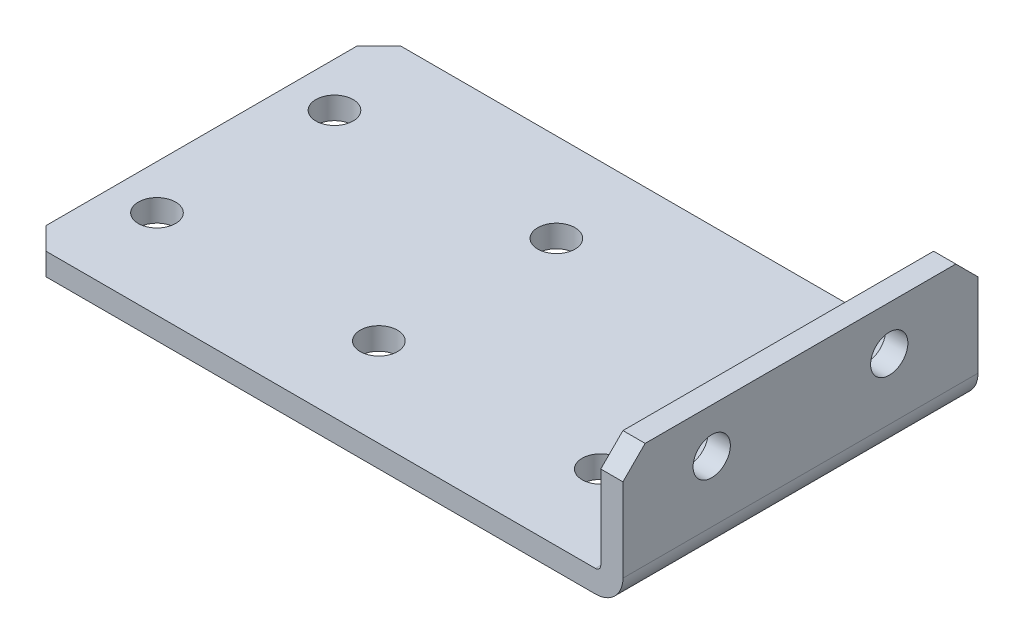
ISO-10303-21;
HEADER;
FILE_DESCRIPTION(('STEP AP214'),'2;1');
FILE_NAME('part.step','',(''),(''),'','','');
FILE_SCHEMA(('AUTOMOTIVE_DESIGN { 1 0 10303 214 1 1 1 1 }'));
ENDSEC;
DATA;
#1=APPLICATION_CONTEXT('core data for automotive mechanical design processes');
#2=APPLICATION_PROTOCOL_DEFINITION('international standard','automotive_design',2000,#1);
#3=PRODUCT_CONTEXT('',#1,'mechanical');
#4=PRODUCT('Part','Part','',(#3));
#5=PRODUCT_RELATED_PRODUCT_CATEGORY('part','',(#4));
#6=PRODUCT_DEFINITION_FORMATION('','',#4);
#7=PRODUCT_DEFINITION_CONTEXT('part definition',#1,'design');
#8=PRODUCT_DEFINITION('design','',#6,#7);
#9=PRODUCT_DEFINITION_SHAPE('','',#8);
#10=(LENGTH_UNIT() NAMED_UNIT(*) SI_UNIT(.MILLI.,.METRE.));
#11=(NAMED_UNIT(*) PLANE_ANGLE_UNIT() SI_UNIT($,.RADIAN.));
#12=(NAMED_UNIT(*) SI_UNIT($,.STERADIAN.) SOLID_ANGLE_UNIT());
#13=UNCERTAINTY_MEASURE_WITH_UNIT(LENGTH_MEASURE(1.E-05),#10,'distance_accuracy_value','');
#14=(GEOMETRIC_REPRESENTATION_CONTEXT(3) GLOBAL_UNCERTAINTY_ASSIGNED_CONTEXT((#13)) GLOBAL_UNIT_ASSIGNED_CONTEXT((#10,
#11,#12)) REPRESENTATION_CONTEXT('',''));
#15=CARTESIAN_POINT('',(0.,0.,0.));
#16=DIRECTION('',(0.,0.,1.));
#17=DIRECTION('',(1.,0.,0.));
#18=AXIS2_PLACEMENT_3D('',#15,#16,#17);
#19=CARTESIAN_POINT('',(85.7250000000001,12.7000000000001,-25.4));
#20=DIRECTION('',(-1.,0.,0.));
#21=DIRECTION('',(0.,-1.,0.));
#22=AXIS2_PLACEMENT_3D('',#19,#20,#21);
#23=CYLINDRICAL_SURFACE('',#22,2.667);
#24=CARTESIAN_POINT('',(85.7250000000001,12.7000000000001,-25.4));
#25=DIRECTION('',(-1.,0.,0.));
#26=DIRECTION('',(0.,-1.,0.));
#27=AXIS2_PLACEMENT_3D('',#24,#25,#26);
#28=CIRCLE('',#27,2.667);
#29=CARTESIAN_POINT('',(85.7250000000001,10.0330000000001,-25.4));
#30=VERTEX_POINT('',#29);
#31=EDGE_CURVE('E208',#30,#30,#28,.F.);
#32=ORIENTED_EDGE('',*,*,#31,.T.);
#33=EDGE_LOOP('',(#32));
#34=FACE_BOUND('',#33,.T.);
#35=CARTESIAN_POINT('',(82.55,12.7000000000001,-25.4));
#36=DIRECTION('',(-1.,0.,0.));
#37=DIRECTION('',(0.,-1.,0.));
#38=AXIS2_PLACEMENT_3D('',#35,#36,#37);
#39=CIRCLE('',#38,2.667);
#40=CARTESIAN_POINT('',(82.55,10.0330000000001,-25.4));
#41=VERTEX_POINT('',#40);
#42=EDGE_CURVE('E213',#41,#41,#39,.F.);
#43=ORIENTED_EDGE('',*,*,#42,.F.);
#44=EDGE_LOOP('',(#43));
#45=FACE_BOUND('',#44,.T.);
#46=ADVANCED_FACE('F18',(#34,#45),#23,.F.);
#47=CARTESIAN_POINT('',(85.7250000000001,12.7000000000001,-50.8));
#48=DIRECTION('',(-1.,0.,0.));
#49=DIRECTION('',(0.,-1.,0.));
#50=AXIS2_PLACEMENT_3D('',#47,#48,#49);
#51=CYLINDRICAL_SURFACE('',#50,2.667);
#52=CARTESIAN_POINT('',(85.7250000000001,12.7000000000001,-50.8));
#53=DIRECTION('',(-1.,0.,0.));
#54=DIRECTION('',(0.,-1.,0.));
#55=AXIS2_PLACEMENT_3D('',#52,#53,#54);
#56=CIRCLE('',#55,2.667);
#57=CARTESIAN_POINT('',(85.7250000000001,10.0330000000001,-50.8));
#58=VERTEX_POINT('',#57);
#59=EDGE_CURVE('E199',#58,#58,#56,.F.);
#60=ORIENTED_EDGE('',*,*,#59,.T.);
#61=EDGE_LOOP('',(#60));
#62=FACE_BOUND('',#61,.T.);
#63=CARTESIAN_POINT('',(82.55,12.7000000000001,-50.8));
#64=DIRECTION('',(-1.,0.,0.));
#65=DIRECTION('',(0.,-1.,0.));
#66=AXIS2_PLACEMENT_3D('',#63,#64,#65);
#67=CIRCLE('',#66,2.667);
#68=CARTESIAN_POINT('',(82.55,10.0330000000001,-50.8));
#69=VERTEX_POINT('',#68);
#70=EDGE_CURVE('E241',#69,#69,#67,.F.);
#71=ORIENTED_EDGE('',*,*,#70,.F.);
#72=EDGE_LOOP('',(#71));
#73=FACE_BOUND('',#72,.T.);
#74=ADVANCED_FACE('F301',(#62,#73),#51,.F.);
#75=CARTESIAN_POINT('',(85.7250000000001,19.05,0.));
#76=DIRECTION('',(0.,-1.,0.));
#77=DIRECTION('',(1.,0.,0.));
#78=AXIS2_PLACEMENT_3D('',#75,#76,#77);
#79=PLANE('',#78);
#80=DIRECTION('',(1.,0.,0.));
#81=VECTOR('',#80,1.);
#82=CARTESIAN_POINT('',(85.7250000000001,19.05,-60.325));
#83=LINE('',#82,#81);
#84=CARTESIAN_POINT('',(85.7250000000001,19.05,-60.325));
#85=VERTEX_POINT('',#84);
#86=CARTESIAN_POINT('',(82.5500000000001,19.05,-60.325));
#87=VERTEX_POINT('',#86);
#88=EDGE_CURVE('E228',#85,#87,#83,.F.);
#89=ORIENTED_EDGE('',*,*,#88,.T.);
#90=DIRECTION('',(0.,0.,1.));
#91=VECTOR('',#90,1.);
#92=CARTESIAN_POINT('',(82.5500000000001,19.05,0.));
#93=LINE('',#92,#91);
#94=CARTESIAN_POINT('',(82.55,19.05,-15.875));
#95=VERTEX_POINT('',#94);
#96=EDGE_CURVE('E244',#95,#87,#93,.F.);
#97=ORIENTED_EDGE('',*,*,#96,.F.);
#98=DIRECTION('',(1.,0.,0.));
#99=VECTOR('',#98,1.);
#100=CARTESIAN_POINT('',(85.7250000000001,19.05,-15.875));
#101=LINE('',#100,#99);
#102=CARTESIAN_POINT('',(85.7250000000001,19.05,-15.875));
#103=VERTEX_POINT('',#102);
#104=EDGE_CURVE('E209',#95,#103,#101,.T.);
#105=ORIENTED_EDGE('',*,*,#104,.T.);
#106=DIRECTION('',(0.,0.,1.));
#107=VECTOR('',#106,1.);
#108=CARTESIAN_POINT('',(85.7250000000001,19.05,0.));
#109=LINE('',#108,#107);
#110=EDGE_CURVE('E198',#103,#85,#109,.F.);
#111=ORIENTED_EDGE('',*,*,#110,.T.);
#112=EDGE_LOOP('',(#89,#97,#105,#111));
#113=FACE_BOUND('',#112,.T.);
#114=ADVANCED_FACE('F306',(#113),#79,.F.);
#115=CARTESIAN_POINT('',(85.7250000000001,19.05,-60.325));
#116=DIRECTION('',(0.,-0.707106781186548,0.707106781186548));
#117=DIRECTION('',(0.,-0.707106781186548,-0.707106781186548));
#118=AXIS2_PLACEMENT_3D('',#115,#116,#117);
#119=PLANE('',#118);
#120=DIRECTION('',(1.,0.,0.));
#121=VECTOR('',#120,1.);
#122=CARTESIAN_POINT('',(85.7250000000001,15.875,-63.5));
#123=LINE('',#122,#121);
#124=CARTESIAN_POINT('',(85.725,15.875,-63.5));
#125=VERTEX_POINT('',#124);
#126=CARTESIAN_POINT('',(82.55,15.875,-63.5));
#127=VERTEX_POINT('',#126);
#128=EDGE_CURVE('E113',#125,#127,#123,.F.);
#129=ORIENTED_EDGE('',*,*,#128,.T.);
#130=DIRECTION('',(0.,-0.707106781186545,-0.70710678118655));
#131=VECTOR('',#130,1.);
#132=CARTESIAN_POINT('',(82.5500000000001,19.05,-60.325));
#133=LINE('',#132,#131);
#134=EDGE_CURVE('E247',#87,#127,#133,.T.);
#135=ORIENTED_EDGE('',*,*,#134,.F.);
#136=ORIENTED_EDGE('',*,*,#88,.F.);
#137=DIRECTION('',(0.,-0.707106781186546,-0.707106781186549));
#138=VECTOR('',#137,1.);
#139=CARTESIAN_POINT('',(85.7250000000001,19.05,-60.325));
#140=LINE('',#139,#138);
#141=EDGE_CURVE('E218',#85,#125,#140,.T.);
#142=ORIENTED_EDGE('',*,*,#141,.T.);
#143=EDGE_LOOP('',(#129,#135,#136,#142));
#144=FACE_BOUND('',#143,.T.);
#145=ADVANCED_FACE('F377',(#144),#119,.F.);
#146=CARTESIAN_POINT('',(81.788,3.937,-63.5));
#147=DIRECTION('',(0.,0.,-1.));
#148=DIRECTION('',(-1.,0.,0.));
#149=AXIS2_PLACEMENT_3D('',#146,#147,#148);
#150=CYLINDRICAL_SURFACE('',#149,0.761999999999999);
#151=CARTESIAN_POINT('',(81.788,3.937,-12.7));
#152=DIRECTION('',(0.,0.,-1.));
#153=DIRECTION('',(-1.,0.,0.));
#154=AXIS2_PLACEMENT_3D('',#151,#152,#153);
#155=CIRCLE('',#154,0.761999999999999);
#156=CARTESIAN_POINT('',(82.55,3.937,-12.7));
#157=VERTEX_POINT('',#156);
#158=CARTESIAN_POINT('',(81.788,3.175,-12.7));
#159=VERTEX_POINT('',#158);
#160=EDGE_CURVE('E21',#157,#159,#155,.T.);
#161=ORIENTED_EDGE('',*,*,#160,.F.);
#162=DIRECTION('',(0.,0.,1.));
#163=VECTOR('',#162,1.);
#164=CARTESIAN_POINT('',(82.55,3.937,0.));
#165=LINE('',#164,#163);
#166=CARTESIAN_POINT('',(82.55,3.93699999999999,-63.5));
#167=VERTEX_POINT('',#166);
#168=EDGE_CURVE('E212',#167,#157,#165,.T.);
#169=ORIENTED_EDGE('',*,*,#168,.F.);
#170=CARTESIAN_POINT('',(81.788,3.937,-63.5));
#171=DIRECTION('',(0.,0.,-1.));
#172=DIRECTION('',(-1.,0.,0.));
#173=AXIS2_PLACEMENT_3D('',#170,#171,#172);
#174=CIRCLE('',#173,0.761999999999999);
#175=CARTESIAN_POINT('',(81.788,3.175,-63.5));
#176=VERTEX_POINT('',#175);
#177=EDGE_CURVE('E112',#167,#176,#174,.T.);
#178=ORIENTED_EDGE('',*,*,#177,.T.);
#179=DIRECTION('',(0.,0.,-1.));
#180=VECTOR('',#179,1.);
#181=CARTESIAN_POINT('',(81.788,3.175,-63.5));
#182=LINE('',#181,#180);
#183=EDGE_CURVE('E115',#176,#159,#182,.F.);
#184=ORIENTED_EDGE('',*,*,#183,.T.);
#185=EDGE_LOOP('',(#161,#169,#178,#184));
#186=FACE_BOUND('',#185,.T.);
#187=ADVANCED_FACE('F116',(#186),#150,.F.);
#188=CARTESIAN_POINT('',(82.5500000000001,19.05,0.));
#189=DIRECTION('',(-1.,0.,0.));
#190=DIRECTION('',(0.,-1.,0.));
#191=AXIS2_PLACEMENT_3D('',#188,#189,#190);
#192=PLANE('',#191);
#193=ORIENTED_EDGE('',*,*,#70,.T.);
#194=EDGE_LOOP('',(#193));
#195=FACE_BOUND('',#194,.T.);
#196=ORIENTED_EDGE('',*,*,#42,.T.);
#197=EDGE_LOOP('',(#196));
#198=FACE_BOUND('',#197,.T.);
#199=DIRECTION('',(0.,1.,0.));
#200=VECTOR('',#199,1.);
#201=CARTESIAN_POINT('',(82.55,0.,-12.7));
#202=LINE('',#201,#200);
#203=CARTESIAN_POINT('',(82.55,15.875,-12.7));
#204=VERTEX_POINT('',#203);
#205=EDGE_CURVE('E111',#157,#204,#202,.T.);
#206=ORIENTED_EDGE('',*,*,#205,.T.);
#207=DIRECTION('',(0.,0.707106781186549,-0.707106781186546));
#208=VECTOR('',#207,1.);
#209=CARTESIAN_POINT('',(82.55,19.05,-15.875));
#210=LINE('',#209,#208);
#211=EDGE_CURVE('E205',#204,#95,#210,.T.);
#212=ORIENTED_EDGE('',*,*,#211,.T.);
#213=ORIENTED_EDGE('',*,*,#96,.T.);
#214=ORIENTED_EDGE('',*,*,#134,.T.);
#215=DIRECTION('',(0.,-1.,0.));
#216=VECTOR('',#215,1.);
#217=CARTESIAN_POINT('',(82.5500000000001,19.05,-63.5));
#218=LINE('',#217,#216);
#219=EDGE_CURVE('E214',#127,#167,#218,.T.);
#220=ORIENTED_EDGE('',*,*,#219,.T.);
#221=ORIENTED_EDGE('',*,*,#168,.T.);
#222=EDGE_LOOP('',(#206,#212,#213,#214,#220,#221));
#223=FACE_BOUND('',#222,.T.);
#224=ADVANCED_FACE('F297',(#195,#198,#223),#192,.T.);
#225=CARTESIAN_POINT('',(85.7250000000001,19.05,-15.875));
#226=DIRECTION('',(0.,-0.707106781186546,-0.707106781186549));
#227=DIRECTION('',(0.,0.707106781186549,-0.707106781186546));
#228=AXIS2_PLACEMENT_3D('',#225,#226,#227);
#229=PLANE('',#228);
#230=DIRECTION('',(-1.,0.,0.));
#231=VECTOR('',#230,1.);
#232=CARTESIAN_POINT('',(-9.42940188980387,15.875,-12.7));
#233=LINE('',#232,#231);
#234=CARTESIAN_POINT('',(85.725,15.875,-12.7));
#235=VERTEX_POINT('',#234);
#236=EDGE_CURVE('E129',#204,#235,#233,.F.);
#237=ORIENTED_EDGE('',*,*,#236,.T.);
#238=DIRECTION('',(0.,0.707106781186549,-0.707106781186546));
#239=VECTOR('',#238,1.);
#240=CARTESIAN_POINT('',(85.725,15.875,-12.7));
#241=LINE('',#240,#239);
#242=EDGE_CURVE('E195',#235,#103,#241,.T.);
#243=ORIENTED_EDGE('',*,*,#242,.T.);
#244=ORIENTED_EDGE('',*,*,#104,.F.);
#245=ORIENTED_EDGE('',*,*,#211,.F.);
#246=EDGE_LOOP('',(#237,#243,#244,#245));
#247=FACE_BOUND('',#246,.T.);
#248=ADVANCED_FACE('F367',(#247),#229,.F.);
#249=CARTESIAN_POINT('',(85.7250000000001,19.05,0.));
#250=DIRECTION('',(-1.,0.,0.));
#251=DIRECTION('',(0.,-1.,0.));
#252=AXIS2_PLACEMENT_3D('',#249,#250,#251);
#253=PLANE('',#252);
#254=ORIENTED_EDGE('',*,*,#141,.F.);
#255=ORIENTED_EDGE('',*,*,#110,.F.);
#256=ORIENTED_EDGE('',*,*,#242,.F.);
#257=DIRECTION('',(0.,1.,0.));
#258=VECTOR('',#257,1.);
#259=CARTESIAN_POINT('',(85.725,0.,-12.7));
#260=LINE('',#259,#258);
#261=CARTESIAN_POINT('',(85.725,3.93699999999999,-12.7));
#262=VERTEX_POINT('',#261);
#263=EDGE_CURVE('E155',#235,#262,#260,.F.);
#264=ORIENTED_EDGE('',*,*,#263,.T.);
#265=DIRECTION('',(0.,0.,-1.));
#266=VECTOR('',#265,1.);
#267=CARTESIAN_POINT('',(85.725,3.93699999999999,-63.5));
#268=LINE('',#267,#266);
#269=CARTESIAN_POINT('',(85.725,3.93699999999999,-63.5));
#270=VERTEX_POINT('',#269);
#271=EDGE_CURVE('E131',#270,#262,#268,.F.);
#272=ORIENTED_EDGE('',*,*,#271,.F.);
#273=DIRECTION('',(0.,-1.,0.));
#274=VECTOR('',#273,1.);
#275=CARTESIAN_POINT('',(85.7250000000001,19.05,-63.5));
#276=LINE('',#275,#274);
#277=EDGE_CURVE('E121',#125,#270,#276,.T.);
#278=ORIENTED_EDGE('',*,*,#277,.F.);
#279=EDGE_LOOP('',(#254,#255,#256,#264,#272,#278));
#280=FACE_BOUND('',#279,.T.);
#281=ORIENTED_EDGE('',*,*,#59,.F.);
#282=EDGE_LOOP('',(#281));
#283=FACE_BOUND('',#282,.T.);
#284=ORIENTED_EDGE('',*,*,#31,.F.);
#285=EDGE_LOOP('',(#284));
#286=FACE_BOUND('',#285,.T.);
#287=ADVANCED_FACE('F364',(#280,#283,#286),#253,.F.);
#288=CARTESIAN_POINT('',(0.,3.175,-63.5));
#289=DIRECTION('',(0.,-1.,0.));
#290=DIRECTION('',(0.,0.,-1.));
#291=AXIS2_PLACEMENT_3D('',#288,#289,#290);
#292=PLANE('',#291);
#293=DIRECTION('',(0.707106781186548,0.,-0.707106781186548));
#294=VECTOR('',#293,1.);
#295=CARTESIAN_POINT('',(3.17500000000001,3.175,-63.5));
#296=LINE('',#295,#294);
#297=CARTESIAN_POINT('',(3.17500000000001,3.175,-63.5));
#298=VERTEX_POINT('',#297);
#299=CARTESIAN_POINT('',(0.,3.175,-60.325));
#300=VERTEX_POINT('',#299);
#301=EDGE_CURVE('E176',#298,#300,#296,.F.);
#302=ORIENTED_EDGE('',*,*,#301,.T.);
#303=DIRECTION('',(0.,0.,-1.));
#304=VECTOR('',#303,1.);
#305=CARTESIAN_POINT('',(0.,3.175,0.));
#306=LINE('',#305,#304);
#307=CARTESIAN_POINT('',(0.,3.175,-15.875));
#308=VERTEX_POINT('',#307);
#309=EDGE_CURVE('E120',#300,#308,#306,.F.);
#310=ORIENTED_EDGE('',*,*,#309,.T.);
#311=DIRECTION('',(-0.707106781186548,0.,-0.707106781186547));
#312=VECTOR('',#311,1.);
#313=CARTESIAN_POINT('',(3.17500000000001,3.175,-12.7));
#314=LINE('',#313,#312);
#315=CARTESIAN_POINT('',(3.17500000000001,3.175,-12.7));
#316=VERTEX_POINT('',#315);
#317=EDGE_CURVE('E126',#308,#316,#314,.F.);
#318=ORIENTED_EDGE('',*,*,#317,.T.);
#319=DIRECTION('',(-1.,0.,0.));
#320=VECTOR('',#319,1.);
#321=CARTESIAN_POINT('',(-9.42940188980387,3.175,-12.7));
#322=LINE('',#321,#320);
#323=EDGE_CURVE('E109',#316,#159,#322,.F.);
#324=ORIENTED_EDGE('',*,*,#323,.T.);
#325=ORIENTED_EDGE('',*,*,#183,.F.);
#326=DIRECTION('',(1.,0.,0.));
#327=VECTOR('',#326,1.);
#328=CARTESIAN_POINT('',(0.,3.175,-63.5));
#329=LINE('',#328,#327);
#330=EDGE_CURVE('E166',#176,#298,#329,.F.);
#331=ORIENTED_EDGE('',*,*,#330,.T.);
#332=EDGE_LOOP('',(#302,#310,#318,#324,#325,#331));
#333=FACE_BOUND('',#332,.T.);
#334=CARTESIAN_POINT('',(6.34999999999999,3.175,-50.8));
#335=DIRECTION('',(0.,1.,0.));
#336=DIRECTION('',(0.,0.,1.));
#337=AXIS2_PLACEMENT_3D('',#334,#335,#336);
#338=CIRCLE('',#337,2.667);
#339=CARTESIAN_POINT('',(6.34999999999999,3.175,-48.133));
#340=VERTEX_POINT('',#339);
#341=EDGE_CURVE('E181',#340,#340,#338,.F.);
#342=ORIENTED_EDGE('',*,*,#341,.T.);
#343=EDGE_LOOP('',(#342));
#344=FACE_BOUND('',#343,.T.);
#345=CARTESIAN_POINT('',(6.35,3.175,-25.4));
#346=DIRECTION('',(0.,1.,0.));
#347=DIRECTION('',(0.,0.,1.));
#348=AXIS2_PLACEMENT_3D('',#345,#346,#347);
#349=CIRCLE('',#348,2.667);
#350=CARTESIAN_POINT('',(6.35,3.175,-22.733));
#351=VERTEX_POINT('',#350);
#352=EDGE_CURVE('E272',#351,#351,#349,.F.);
#353=ORIENTED_EDGE('',*,*,#352,.T.);
#354=EDGE_LOOP('',(#353));
#355=FACE_BOUND('',#354,.T.);
#356=CARTESIAN_POINT('',(69.85,3.175,-50.8));
#357=DIRECTION('',(0.,1.,0.));
#358=DIRECTION('',(0.,0.,1.));
#359=AXIS2_PLACEMENT_3D('',#356,#357,#358);
#360=CIRCLE('',#359,2.667);
#361=CARTESIAN_POINT('',(69.85,3.175,-48.133));
#362=VERTEX_POINT('',#361);
#363=EDGE_CURVE('E275',#362,#362,#360,.F.);
#364=ORIENTED_EDGE('',*,*,#363,.T.);
#365=EDGE_LOOP('',(#364));
#366=FACE_BOUND('',#365,.T.);
#367=CARTESIAN_POINT('',(69.85,3.175,-25.4));
#368=DIRECTION('',(0.,1.,0.));
#369=DIRECTION('',(0.,0.,1.));
#370=AXIS2_PLACEMENT_3D('',#367,#368,#369);
#371=CIRCLE('',#370,2.667);
#372=CARTESIAN_POINT('',(69.85,3.175,-22.733));
#373=VERTEX_POINT('',#372);
#374=EDGE_CURVE('E278',#373,#373,#371,.F.);
#375=ORIENTED_EDGE('',*,*,#374,.T.);
#376=EDGE_LOOP('',(#375));
#377=FACE_BOUND('',#376,.T.);
#378=CARTESIAN_POINT('',(38.1,3.175,-50.8));
#379=DIRECTION('',(0.,1.,0.));
#380=DIRECTION('',(0.,0.,1.));
#381=AXIS2_PLACEMENT_3D('',#378,#379,#380);
#382=CIRCLE('',#381,2.667);
#383=CARTESIAN_POINT('',(38.1,3.175,-48.133));
#384=VERTEX_POINT('',#383);
#385=EDGE_CURVE('E281',#384,#384,#382,.F.);
#386=ORIENTED_EDGE('',*,*,#385,.T.);
#387=EDGE_LOOP('',(#386));
#388=FACE_BOUND('',#387,.T.);
#389=CARTESIAN_POINT('',(38.1,3.175,-25.4));
#390=DIRECTION('',(0.,1.,0.));
#391=DIRECTION('',(0.,0.,1.));
#392=AXIS2_PLACEMENT_3D('',#389,#390,#391);
#393=CIRCLE('',#392,2.667);
#394=CARTESIAN_POINT('',(38.1,3.175,-22.733));
#395=VERTEX_POINT('',#394);
#396=EDGE_CURVE('E192',#395,#395,#393,.F.);
#397=ORIENTED_EDGE('',*,*,#396,.T.);
#398=EDGE_LOOP('',(#397));
#399=FACE_BOUND('',#398,.T.);
#400=ADVANCED_FACE('F123',(#333,#344,#355,#366,#377,#388,#399),#292,.F.);
#401=CARTESIAN_POINT('',(0.,3.175,0.));
#402=DIRECTION('',(1.,0.,0.));
#403=DIRECTION('',(0.,0.,-1.));
#404=AXIS2_PLACEMENT_3D('',#401,#402,#403);
#405=PLANE('',#404);
#406=DIRECTION('',(0.,1.,0.));
#407=VECTOR('',#406,1.);
#408=CARTESIAN_POINT('',(0.,3.175,-60.325));
#409=LINE('',#408,#407);
#410=CARTESIAN_POINT('',(0.,0.,-60.325));
#411=VERTEX_POINT('',#410);
#412=EDGE_CURVE('E174',#300,#411,#409,.F.);
#413=ORIENTED_EDGE('',*,*,#412,.T.);
#414=DIRECTION('',(0.,0.,-1.));
#415=VECTOR('',#414,1.);
#416=CARTESIAN_POINT('',(0.,0.,-63.5));
#417=LINE('',#416,#415);
#418=CARTESIAN_POINT('',(0.,0.,-15.875));
#419=VERTEX_POINT('',#418);
#420=EDGE_CURVE('E171',#419,#411,#417,.T.);
#421=ORIENTED_EDGE('',*,*,#420,.F.);
#422=DIRECTION('',(0.,1.,0.));
#423=VECTOR('',#422,1.);
#424=CARTESIAN_POINT('',(0.,0.,-15.875));
#425=LINE('',#424,#423);
#426=EDGE_CURVE('E154',#419,#308,#425,.T.);
#427=ORIENTED_EDGE('',*,*,#426,.T.);
#428=ORIENTED_EDGE('',*,*,#309,.F.);
#429=EDGE_LOOP('',(#413,#421,#427,#428));
#430=FACE_BOUND('',#429,.T.);
#431=ADVANCED_FACE('F357',(#430),#405,.F.);
#432=CARTESIAN_POINT('',(3.17500000000001,3.175,-63.5));
#433=DIRECTION('',(0.707106781186548,0.,0.707106781186548));
#434=DIRECTION('',(0.707106781186548,0.,-0.707106781186548));
#435=AXIS2_PLACEMENT_3D('',#432,#433,#434);
#436=PLANE('',#435);
#437=ORIENTED_EDGE('',*,*,#412,.F.);
#438=ORIENTED_EDGE('',*,*,#301,.F.);
#439=DIRECTION('',(0.,1.,0.));
#440=VECTOR('',#439,1.);
#441=CARTESIAN_POINT('',(3.17500000000001,3.175,-63.5));
#442=LINE('',#441,#440);
#443=CARTESIAN_POINT('',(3.17500000000001,0.,-63.5));
#444=VERTEX_POINT('',#443);
#445=EDGE_CURVE('E163',#298,#444,#442,.F.);
#446=ORIENTED_EDGE('',*,*,#445,.T.);
#447=DIRECTION('',(0.707106781186547,0.,-0.707106781186548));
#448=VECTOR('',#447,1.);
#449=CARTESIAN_POINT('',(0.,0.,-60.325));
#450=LINE('',#449,#448);
#451=EDGE_CURVE('E160',#411,#444,#450,.T.);
#452=ORIENTED_EDGE('',*,*,#451,.F.);
#453=EDGE_LOOP('',(#437,#438,#446,#452));
#454=FACE_BOUND('',#453,.T.);
#455=ADVANCED_FACE('F353',(#454),#436,.F.);
#456=CARTESIAN_POINT('',(0.,3.175,-63.5));
#457=DIRECTION('',(0.,0.,1.));
#458=DIRECTION('',(1.,0.,0.));
#459=AXIS2_PLACEMENT_3D('',#456,#457,#458);
#460=PLANE('',#459);
#461=ORIENTED_EDGE('',*,*,#445,.F.);
#462=ORIENTED_EDGE('',*,*,#330,.F.);
#463=ORIENTED_EDGE('',*,*,#177,.F.);
#464=ORIENTED_EDGE('',*,*,#219,.F.);
#465=ORIENTED_EDGE('',*,*,#128,.F.);
#466=ORIENTED_EDGE('',*,*,#277,.T.);
#467=CARTESIAN_POINT('',(81.788,3.937,-63.5));
#468=DIRECTION('',(0.,0.,-1.));
#469=DIRECTION('',(-1.,0.,0.));
#470=AXIS2_PLACEMENT_3D('',#467,#468,#469);
#471=CIRCLE('',#470,3.937);
#472=CARTESIAN_POINT('',(81.788,0.,-63.5));
#473=VERTEX_POINT('',#472);
#474=EDGE_CURVE('E165',#473,#270,#471,.F.);
#475=ORIENTED_EDGE('',*,*,#474,.F.);
#476=DIRECTION('',(1.,0.,0.));
#477=VECTOR('',#476,1.);
#478=CARTESIAN_POINT('',(0.,0.,-63.5));
#479=LINE('',#478,#477);
#480=EDGE_CURVE('E142',#444,#473,#479,.T.);
#481=ORIENTED_EDGE('',*,*,#480,.F.);
#482=EDGE_LOOP('',(#461,#462,#463,#464,#465,#466,#475,#481));
#483=FACE_BOUND('',#482,.T.);
#484=ADVANCED_FACE('F349',(#483),#460,.F.);
#485=CARTESIAN_POINT('',(81.788,3.937,-63.5));
#486=DIRECTION('',(0.,0.,-1.));
#487=DIRECTION('',(-1.,0.,0.));
#488=AXIS2_PLACEMENT_3D('',#485,#486,#487);
#489=CYLINDRICAL_SURFACE('',#488,3.937);
#490=ORIENTED_EDGE('',*,*,#474,.T.);
#491=ORIENTED_EDGE('',*,*,#271,.T.);
#492=CARTESIAN_POINT('',(81.788,3.937,-12.7));
#493=DIRECTION('',(0.,0.,-1.));
#494=DIRECTION('',(-1.,0.,0.));
#495=AXIS2_PLACEMENT_3D('',#492,#493,#494);
#496=CIRCLE('',#495,3.937);
#497=CARTESIAN_POINT('',(81.788,0.,-12.7));
#498=VERTEX_POINT('',#497);
#499=EDGE_CURVE('E127',#262,#498,#496,.T.);
#500=ORIENTED_EDGE('',*,*,#499,.T.);
#501=DIRECTION('',(0.,0.,-1.));
#502=VECTOR('',#501,1.);
#503=CARTESIAN_POINT('',(81.788,0.,-63.5));
#504=LINE('',#503,#502);
#505=EDGE_CURVE('E138',#473,#498,#504,.F.);
#506=ORIENTED_EDGE('',*,*,#505,.F.);
#507=EDGE_LOOP('',(#490,#491,#500,#506));
#508=FACE_BOUND('',#507,.T.);
#509=ADVANCED_FACE('F346',(#508),#489,.T.);
#510=CARTESIAN_POINT('',(-9.42940188980387,0.,-12.7));
#511=DIRECTION('',(0.,0.,-1.));
#512=DIRECTION('',(-1.,0.,0.));
#513=AXIS2_PLACEMENT_3D('',#510,#511,#512);
#514=PLANE('',#513);
#515=ORIENTED_EDGE('',*,*,#236,.F.);
#516=ORIENTED_EDGE('',*,*,#205,.F.);
#517=ORIENTED_EDGE('',*,*,#160,.T.);
#518=ORIENTED_EDGE('',*,*,#323,.F.);
#519=DIRECTION('',(0.,1.,0.));
#520=VECTOR('',#519,1.);
#521=CARTESIAN_POINT('',(3.17500000000001,0.,-12.7));
#522=LINE('',#521,#520);
#523=CARTESIAN_POINT('',(3.17500000000001,0.,-12.7));
#524=VERTEX_POINT('',#523);
#525=EDGE_CURVE('E36',#316,#524,#522,.F.);
#526=ORIENTED_EDGE('',*,*,#525,.T.);
#527=DIRECTION('',(1.,0.,0.));
#528=VECTOR('',#527,1.);
#529=CARTESIAN_POINT('',(0.,0.,-12.7));
#530=LINE('',#529,#528);
#531=EDGE_CURVE('E141',#498,#524,#530,.F.);
#532=ORIENTED_EDGE('',*,*,#531,.F.);
#533=ORIENTED_EDGE('',*,*,#499,.F.);
#534=ORIENTED_EDGE('',*,*,#263,.F.);
#535=EDGE_LOOP('',(#515,#516,#517,#518,#526,#532,#533,#534));
#536=FACE_BOUND('',#535,.T.);
#537=ADVANCED_FACE('F107',(#536),#514,.F.);
#538=CARTESIAN_POINT('',(3.17500000000001,0.,-12.7));
#539=DIRECTION('',(0.707106781186547,0.,-0.707106781186548));
#540=DIRECTION('',(-0.707106781186548,0.,-0.707106781186547));
#541=AXIS2_PLACEMENT_3D('',#538,#539,#540);
#542=PLANE('',#541);
#543=ORIENTED_EDGE('',*,*,#426,.F.);
#544=DIRECTION('',(-0.707106781186547,0.,-0.707106781186548));
#545=VECTOR('',#544,1.);
#546=CARTESIAN_POINT('',(3.17500000000001,0.,-12.7));
#547=LINE('',#546,#545);
#548=EDGE_CURVE('E145',#524,#419,#547,.T.);
#549=ORIENTED_EDGE('',*,*,#548,.F.);
#550=ORIENTED_EDGE('',*,*,#525,.F.);
#551=ORIENTED_EDGE('',*,*,#317,.F.);
#552=EDGE_LOOP('',(#543,#549,#550,#551));
#553=FACE_BOUND('',#552,.T.);
#554=ADVANCED_FACE('F339',(#553),#542,.F.);
#555=CARTESIAN_POINT('',(38.1,0.,-25.4));
#556=DIRECTION('',(0.,1.,0.));
#557=DIRECTION('',(0.,0.,1.));
#558=AXIS2_PLACEMENT_3D('',#555,#556,#557);
#559=CYLINDRICAL_SURFACE('',#558,2.667);
#560=ORIENTED_EDGE('',*,*,#396,.F.);
#561=EDGE_LOOP('',(#560));
#562=FACE_BOUND('',#561,.T.);
#563=CARTESIAN_POINT('',(38.1,0.,-25.4));
#564=DIRECTION('',(0.,1.,0.));
#565=DIRECTION('',(0.,0.,1.));
#566=AXIS2_PLACEMENT_3D('',#563,#564,#565);
#567=CIRCLE('',#566,2.667);
#568=CARTESIAN_POINT('',(38.1,0.,-22.733));
#569=VERTEX_POINT('',#568);
#570=EDGE_CURVE('E150',#569,#569,#567,.T.);
#571=ORIENTED_EDGE('',*,*,#570,.F.);
#572=EDGE_LOOP('',(#571));
#573=FACE_BOUND('',#572,.T.);
#574=ADVANCED_FACE('F335',(#562,#573),#559,.F.);
#575=CARTESIAN_POINT('',(38.1,0.,-50.8));
#576=DIRECTION('',(0.,1.,0.));
#577=DIRECTION('',(0.,0.,1.));
#578=AXIS2_PLACEMENT_3D('',#575,#576,#577);
#579=CYLINDRICAL_SURFACE('',#578,2.667);
#580=ORIENTED_EDGE('',*,*,#385,.F.);
#581=EDGE_LOOP('',(#580));
#582=FACE_BOUND('',#581,.T.);
#583=CARTESIAN_POINT('',(38.1,0.,-50.8));
#584=DIRECTION('',(0.,1.,0.));
#585=DIRECTION('',(0.,0.,1.));
#586=AXIS2_PLACEMENT_3D('',#583,#584,#585);
#587=CIRCLE('',#586,2.667);
#588=CARTESIAN_POINT('',(38.1,0.,-48.133));
#589=VERTEX_POINT('',#588);
#590=EDGE_CURVE('E265',#589,#589,#587,.T.);
#591=ORIENTED_EDGE('',*,*,#590,.F.);
#592=EDGE_LOOP('',(#591));
#593=FACE_BOUND('',#592,.T.);
#594=ADVANCED_FACE('F331',(#582,#593),#579,.F.);
#595=CARTESIAN_POINT('',(69.85,0.,-25.4));
#596=DIRECTION('',(0.,1.,0.));
#597=DIRECTION('',(0.,0.,1.));
#598=AXIS2_PLACEMENT_3D('',#595,#596,#597);
#599=CYLINDRICAL_SURFACE('',#598,2.667);
#600=ORIENTED_EDGE('',*,*,#374,.F.);
#601=EDGE_LOOP('',(#600));
#602=FACE_BOUND('',#601,.T.);
#603=CARTESIAN_POINT('',(69.85,0.,-25.4));
#604=DIRECTION('',(0.,1.,0.));
#605=DIRECTION('',(0.,0.,1.));
#606=AXIS2_PLACEMENT_3D('',#603,#604,#605);
#607=CIRCLE('',#606,2.667);
#608=CARTESIAN_POINT('',(69.85,0.,-22.733));
#609=VERTEX_POINT('',#608);
#610=EDGE_CURVE('E262',#609,#609,#607,.T.);
#611=ORIENTED_EDGE('',*,*,#610,.F.);
#612=EDGE_LOOP('',(#611));
#613=FACE_BOUND('',#612,.T.);
#614=ADVANCED_FACE('F327',(#602,#613),#599,.F.);
#615=CARTESIAN_POINT('',(69.85,0.,-50.8));
#616=DIRECTION('',(0.,1.,0.));
#617=DIRECTION('',(0.,0.,1.));
#618=AXIS2_PLACEMENT_3D('',#615,#616,#617);
#619=CYLINDRICAL_SURFACE('',#618,2.667);
#620=ORIENTED_EDGE('',*,*,#363,.F.);
#621=EDGE_LOOP('',(#620));
#622=FACE_BOUND('',#621,.T.);
#623=CARTESIAN_POINT('',(69.85,0.,-50.8));
#624=DIRECTION('',(0.,1.,0.));
#625=DIRECTION('',(0.,0.,1.));
#626=AXIS2_PLACEMENT_3D('',#623,#624,#625);
#627=CIRCLE('',#626,2.667);
#628=CARTESIAN_POINT('',(69.85,0.,-48.133));
#629=VERTEX_POINT('',#628);
#630=EDGE_CURVE('E259',#629,#629,#627,.T.);
#631=ORIENTED_EDGE('',*,*,#630,.F.);
#632=EDGE_LOOP('',(#631));
#633=FACE_BOUND('',#632,.T.);
#634=ADVANCED_FACE('F323',(#622,#633),#619,.F.);
#635=CARTESIAN_POINT('',(6.35,0.,-25.4));
#636=DIRECTION('',(0.,1.,0.));
#637=DIRECTION('',(0.,0.,1.));
#638=AXIS2_PLACEMENT_3D('',#635,#636,#637);
#639=CYLINDRICAL_SURFACE('',#638,2.667);
#640=ORIENTED_EDGE('',*,*,#352,.F.);
#641=EDGE_LOOP('',(#640));
#642=FACE_BOUND('',#641,.T.);
#643=CARTESIAN_POINT('',(6.35,0.,-25.4));
#644=DIRECTION('',(0.,1.,0.));
#645=DIRECTION('',(0.,0.,1.));
#646=AXIS2_PLACEMENT_3D('',#643,#644,#645);
#647=CIRCLE('',#646,2.667);
#648=CARTESIAN_POINT('',(6.35,0.,-22.733));
#649=VERTEX_POINT('',#648);
#650=EDGE_CURVE('E27',#649,#649,#647,.T.);
#651=ORIENTED_EDGE('',*,*,#650,.F.);
#652=EDGE_LOOP('',(#651));
#653=FACE_BOUND('',#652,.T.);
#654=ADVANCED_FACE('F316',(#642,#653),#639,.F.);
#655=CARTESIAN_POINT('',(6.34999999999999,0.,-50.8));
#656=DIRECTION('',(0.,1.,0.));
#657=DIRECTION('',(0.,0.,1.));
#658=AXIS2_PLACEMENT_3D('',#655,#656,#657);
#659=CYLINDRICAL_SURFACE('',#658,2.667);
#660=ORIENTED_EDGE('',*,*,#341,.F.);
#661=EDGE_LOOP('',(#660));
#662=FACE_BOUND('',#661,.T.);
#663=CARTESIAN_POINT('',(6.34999999999999,0.,-50.8));
#664=DIRECTION('',(0.,1.,0.));
#665=DIRECTION('',(0.,0.,1.));
#666=AXIS2_PLACEMENT_3D('',#663,#664,#665);
#667=CIRCLE('',#666,2.667);
#668=CARTESIAN_POINT('',(6.34999999999999,0.,-48.133));
#669=VERTEX_POINT('',#668);
#670=EDGE_CURVE('E11',#669,#669,#667,.T.);
#671=ORIENTED_EDGE('',*,*,#670,.F.);
#672=EDGE_LOOP('',(#671));
#673=FACE_BOUND('',#672,.T.);
#674=ADVANCED_FACE('F310',(#662,#673),#659,.F.);
#675=CARTESIAN_POINT('',(0.,0.,-63.5));
#676=DIRECTION('',(0.,-1.,0.));
#677=DIRECTION('',(0.,0.,-1.));
#678=AXIS2_PLACEMENT_3D('',#675,#676,#677);
#679=PLANE('',#678);
#680=ORIENTED_EDGE('',*,*,#670,.T.);
#681=EDGE_LOOP('',(#680));
#682=FACE_BOUND('',#681,.T.);
#683=ORIENTED_EDGE('',*,*,#650,.T.);
#684=EDGE_LOOP('',(#683));
#685=FACE_BOUND('',#684,.T.);
#686=ORIENTED_EDGE('',*,*,#630,.T.);
#687=EDGE_LOOP('',(#686));
#688=FACE_BOUND('',#687,.T.);
#689=ORIENTED_EDGE('',*,*,#610,.T.);
#690=EDGE_LOOP('',(#689));
#691=FACE_BOUND('',#690,.T.);
#692=ORIENTED_EDGE('',*,*,#590,.T.);
#693=EDGE_LOOP('',(#692));
#694=FACE_BOUND('',#693,.T.);
#695=ORIENTED_EDGE('',*,*,#570,.T.);
#696=EDGE_LOOP('',(#695));
#697=FACE_BOUND('',#696,.T.);
#698=ORIENTED_EDGE('',*,*,#531,.T.);
#699=ORIENTED_EDGE('',*,*,#548,.T.);
#700=ORIENTED_EDGE('',*,*,#420,.T.);
#701=ORIENTED_EDGE('',*,*,#451,.T.);
#702=ORIENTED_EDGE('',*,*,#480,.T.);
#703=ORIENTED_EDGE('',*,*,#505,.T.);
#704=EDGE_LOOP('',(#698,#699,#700,#701,#702,#703));
#705=FACE_BOUND('',#704,.T.);
#706=ADVANCED_FACE('F308',(#682,#685,#688,#691,#694,#697,#705),#679,.T.);
#707=CLOSED_SHELL('',(#46,#74,#114,#145,#187,#224,#248,#287,#400,#431,#455,#484,#509,#537,#554,
#574,#594,#614,#634,#654,#674,#706));
#708=MANIFOLD_SOLID_BREP('B1',#707);
#709=ADVANCED_BREP_SHAPE_REPRESENTATION('',(#18,#708),#14);
#710=SHAPE_DEFINITION_REPRESENTATION(#9,#709);
ENDSEC;
END-ISO-10303-21;
